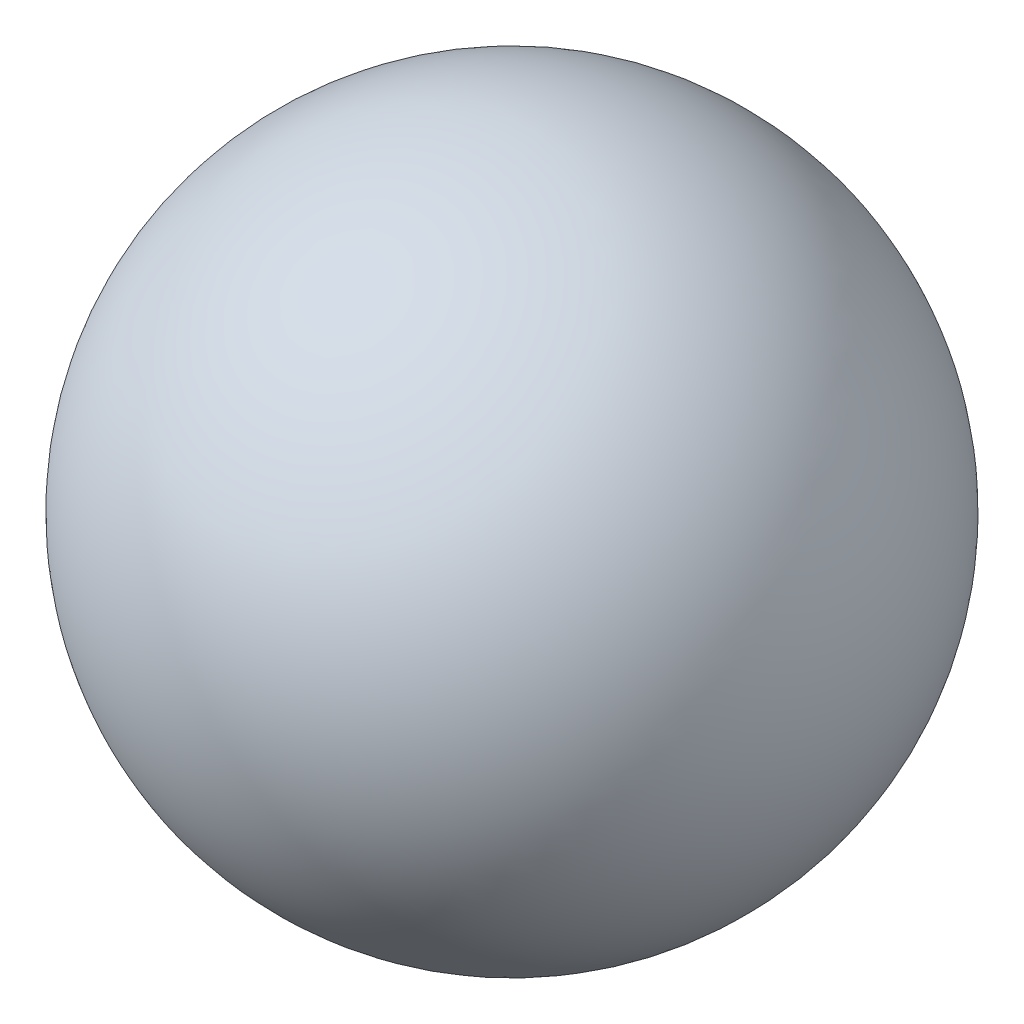
ISO-10303-21;
HEADER;
FILE_DESCRIPTION(('STEP AP214'),'2;1');
FILE_NAME('part.step','',(''),(''),'','','');
FILE_SCHEMA(('AUTOMOTIVE_DESIGN { 1 0 10303 214 1 1 1 1 }'));
ENDSEC;
DATA;
#1=APPLICATION_CONTEXT('core data for automotive mechanical design processes');
#2=APPLICATION_PROTOCOL_DEFINITION('international standard','automotive_design',2000,#1);
#3=PRODUCT_CONTEXT('',#1,'mechanical');
#4=PRODUCT('Part','Part','',(#3));
#5=PRODUCT_RELATED_PRODUCT_CATEGORY('part','',(#4));
#6=PRODUCT_DEFINITION_FORMATION('','',#4);
#7=PRODUCT_DEFINITION_CONTEXT('part definition',#1,'design');
#8=PRODUCT_DEFINITION('design','',#6,#7);
#9=PRODUCT_DEFINITION_SHAPE('','',#8);
#10=(LENGTH_UNIT() NAMED_UNIT(*) SI_UNIT(.MILLI.,.METRE.));
#11=(NAMED_UNIT(*) PLANE_ANGLE_UNIT() SI_UNIT($,.RADIAN.));
#12=(NAMED_UNIT(*) SI_UNIT($,.STERADIAN.) SOLID_ANGLE_UNIT());
#13=UNCERTAINTY_MEASURE_WITH_UNIT(LENGTH_MEASURE(1.E-05),#10,'distance_accuracy_value','');
#14=(GEOMETRIC_REPRESENTATION_CONTEXT(3) GLOBAL_UNCERTAINTY_ASSIGNED_CONTEXT((#13)) GLOBAL_UNIT_ASSIGNED_CONTEXT((#10,
#11,#12)) REPRESENTATION_CONTEXT('',''));
#15=CARTESIAN_POINT('',(0.,0.,0.));
#16=DIRECTION('',(0.,0.,1.));
#17=DIRECTION('',(1.,0.,0.));
#18=AXIS2_PLACEMENT_3D('',#15,#16,#17);
#19=CARTESIAN_POINT('',(0.,0.,0.));
#20=DIRECTION('',(0.,0.,-1.));
#21=DIRECTION('',(1.,0.,0.));
#22=AXIS2_PLACEMENT_3D('',#19,#20,#21);
#23=SPHERICAL_SURFACE('',#22,2.9);
#24=CARTESIAN_POINT('',(0.,0.,-2.9));
#25=VERTEX_POINT('',#24);
#26=VERTEX_LOOP('',#25);
#27=FACE_BOUND('',#26,.T.);
#28=ADVANCED_FACE('F43',(#27),#23,.T.);
#29=CLOSED_SHELL('',(#28));
#30=MANIFOLD_SOLID_BREP('B2',#29);
#31=ADVANCED_BREP_SHAPE_REPRESENTATION('',(#18,#30),#14);
#32=SHAPE_DEFINITION_REPRESENTATION(#9,#31);
ENDSEC;
END-ISO-10303-21;
